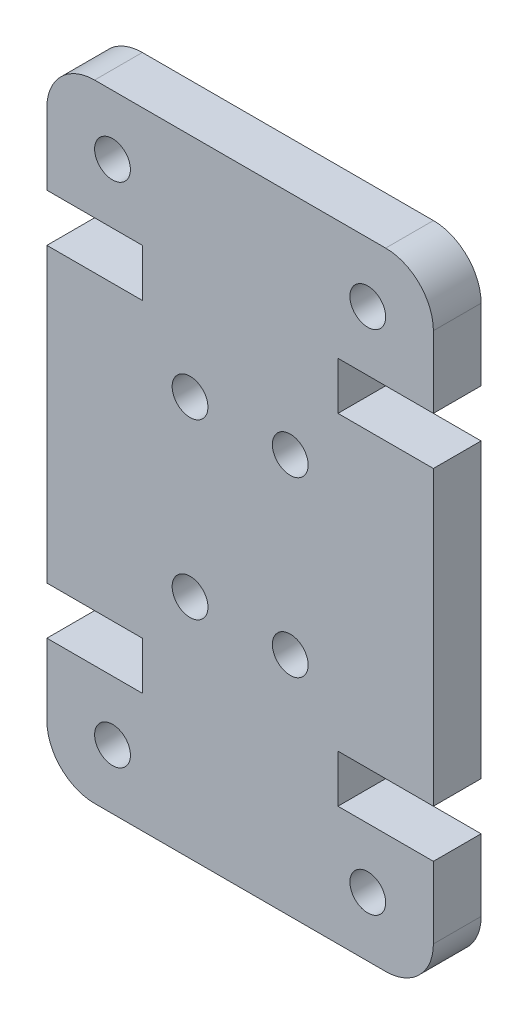
ISO-10303-21;
HEADER;
FILE_DESCRIPTION(('STEP AP214'),'2;1');
FILE_NAME('part.step','',(''),(''),'','','');
FILE_SCHEMA(('AUTOMOTIVE_DESIGN { 1 0 10303 214 1 1 1 1 }'));
ENDSEC;
DATA;
#1=APPLICATION_CONTEXT('core data for automotive mechanical design processes');
#2=APPLICATION_PROTOCOL_DEFINITION('international standard','automotive_design',2000,#1);
#3=PRODUCT_CONTEXT('',#1,'mechanical');
#4=PRODUCT('Part','Part','',(#3));
#5=PRODUCT_RELATED_PRODUCT_CATEGORY('part','',(#4));
#6=PRODUCT_DEFINITION_FORMATION('','',#4);
#7=PRODUCT_DEFINITION_CONTEXT('part definition',#1,'design');
#8=PRODUCT_DEFINITION('design','',#6,#7);
#9=PRODUCT_DEFINITION_SHAPE('','',#8);
#10=(LENGTH_UNIT() NAMED_UNIT(*) SI_UNIT(.MILLI.,.METRE.));
#11=(NAMED_UNIT(*) PLANE_ANGLE_UNIT() SI_UNIT($,.RADIAN.));
#12=(NAMED_UNIT(*) SI_UNIT($,.STERADIAN.) SOLID_ANGLE_UNIT());
#13=UNCERTAINTY_MEASURE_WITH_UNIT(LENGTH_MEASURE(1.E-05),#10,'distance_accuracy_value','');
#14=(GEOMETRIC_REPRESENTATION_CONTEXT(3) GLOBAL_UNCERTAINTY_ASSIGNED_CONTEXT((#13)) GLOBAL_UNIT_ASSIGNED_CONTEXT((#10,
#11,#12)) REPRESENTATION_CONTEXT('',''));
#15=CARTESIAN_POINT('',(0.,0.,0.));
#16=DIRECTION('',(0.,0.,1.));
#17=DIRECTION('',(1.,0.,0.));
#18=AXIS2_PLACEMENT_3D('',#15,#16,#17);
#19=CARTESIAN_POINT('',(14.2,2.,2.));
#20=DIRECTION('',(0.,0.,-1.));
#21=DIRECTION('',(-1.,0.,0.));
#22=AXIS2_PLACEMENT_3D('',#19,#20,#21);
#23=PLANE('',#22);
#24=CARTESIAN_POINT('',(6.00000000000001,9.49999999999963,2.));
#25=DIRECTION('',(0.,0.,1.));
#26=DIRECTION('',(1.,0.,0.));
#27=AXIS2_PLACEMENT_3D('',#24,#25,#26);
#28=CIRCLE('',#27,0.749999999999999);
#29=CARTESIAN_POINT('',(6.75,9.49999999999963,2.));
#30=VERTEX_POINT('',#29);
#31=EDGE_CURVE('E464',#30,#30,#28,.T.);
#32=ORIENTED_EDGE('',*,*,#31,.F.);
#33=EDGE_LOOP('',(#32));
#34=FACE_BOUND('',#33,.T.);
#35=CARTESIAN_POINT('',(10.2,16.7600000000004,2.));
#36=DIRECTION('',(0.,0.,1.));
#37=DIRECTION('',(1.,0.,0.));
#38=AXIS2_PLACEMENT_3D('',#35,#36,#37);
#39=CIRCLE('',#38,0.749999999999999);
#40=CARTESIAN_POINT('',(10.95,16.7600000000004,2.));
#41=VERTEX_POINT('',#40);
#42=EDGE_CURVE('E476',#41,#41,#39,.T.);
#43=ORIENTED_EDGE('',*,*,#42,.F.);
#44=EDGE_LOOP('',(#43));
#45=FACE_BOUND('',#44,.T.);
#46=CARTESIAN_POINT('',(2.75000000000002,23.7599999999998,2.));
#47=DIRECTION('',(0.,0.,1.));
#48=DIRECTION('',(-1.,0.,0.));
#49=AXIS2_PLACEMENT_3D('',#46,#47,#48);
#50=CIRCLE('',#49,0.749999999999999);
#51=CARTESIAN_POINT('',(2.00000000000003,23.7599999999998,2.));
#52=VERTEX_POINT('',#51);
#53=EDGE_CURVE('E488',#52,#52,#50,.T.);
#54=ORIENTED_EDGE('',*,*,#53,.F.);
#55=EDGE_LOOP('',(#54));
#56=FACE_BOUND('',#55,.T.);
#57=CARTESIAN_POINT('',(13.45,2.50000000000017,2.));
#58=DIRECTION('',(0.,0.,1.));
#59=DIRECTION('',(-1.,0.,0.));
#60=AXIS2_PLACEMENT_3D('',#57,#58,#59);
#61=CIRCLE('',#60,0.750000000000004);
#62=CARTESIAN_POINT('',(12.7,2.50000000000017,2.));
#63=VERTEX_POINT('',#62);
#64=EDGE_CURVE('E230',#63,#63,#61,.T.);
#65=ORIENTED_EDGE('',*,*,#64,.F.);
#66=EDGE_LOOP('',(#65));
#67=FACE_BOUND('',#66,.T.);
#68=CARTESIAN_POINT('',(14.2,2.,2.));
#69=DIRECTION('',(0.,0.,1.));
#70=DIRECTION('',(-1.,0.,0.));
#71=AXIS2_PLACEMENT_3D('',#68,#69,#70);
#72=CIRCLE('',#71,2.);
#73=CARTESIAN_POINT('',(14.2,0.,2.));
#74=VERTEX_POINT('',#73);
#75=CARTESIAN_POINT('',(16.2,2.,2.));
#76=VERTEX_POINT('',#75);
#77=EDGE_CURVE('E273',#74,#76,#72,.T.);
#78=ORIENTED_EDGE('',*,*,#77,.T.);
#79=DIRECTION('',(0.,1.,0.));
#80=VECTOR('',#79,1.);
#81=CARTESIAN_POINT('',(16.2,2.,2.));
#82=LINE('',#81,#80);
#83=CARTESIAN_POINT('',(16.2,4.99999999999945,2.));
#84=VERTEX_POINT('',#83);
#85=EDGE_CURVE('E141',#76,#84,#82,.T.);
#86=ORIENTED_EDGE('',*,*,#85,.T.);
#87=DIRECTION('',(-1.,0.,0.));
#88=VECTOR('',#87,1.);
#89=CARTESIAN_POINT('',(12.2,4.99999999999945,2.));
#90=LINE('',#89,#88);
#91=CARTESIAN_POINT('',(12.2,4.99999999999945,2.));
#92=VERTEX_POINT('',#91);
#93=EDGE_CURVE('E336',#84,#92,#90,.T.);
#94=ORIENTED_EDGE('',*,*,#93,.T.);
#95=DIRECTION('',(0.,1.,0.));
#96=VECTOR('',#95,1.);
#97=CARTESIAN_POINT('',(12.2,6.99999999999945,2.));
#98=LINE('',#97,#96);
#99=CARTESIAN_POINT('',(12.2,6.99999999999945,2.));
#100=VERTEX_POINT('',#99);
#101=EDGE_CURVE('E355',#92,#100,#98,.T.);
#102=ORIENTED_EDGE('',*,*,#101,.T.);
#103=DIRECTION('',(1.,0.,0.));
#104=VECTOR('',#103,1.);
#105=CARTESIAN_POINT('',(16.2,6.99999999999945,2.));
#106=LINE('',#105,#104);
#107=CARTESIAN_POINT('',(16.2,6.99999999999945,2.));
#108=VERTEX_POINT('',#107);
#109=EDGE_CURVE('E352',#100,#108,#106,.T.);
#110=ORIENTED_EDGE('',*,*,#109,.T.);
#111=DIRECTION('',(0.,1.,0.));
#112=VECTOR('',#111,1.);
#113=CARTESIAN_POINT('',(16.2,6.99999999999945,2.));
#114=LINE('',#113,#112);
#115=CARTESIAN_POINT('',(16.2,19.2600000000005,2.));
#116=VERTEX_POINT('',#115);
#117=EDGE_CURVE('E354',#108,#116,#114,.T.);
#118=ORIENTED_EDGE('',*,*,#117,.T.);
#119=DIRECTION('',(-1.,0.,0.));
#120=VECTOR('',#119,1.);
#121=CARTESIAN_POINT('',(16.2,19.2600000000005,2.));
#122=LINE('',#121,#120);
#123=CARTESIAN_POINT('',(12.2,19.2600000000005,2.));
#124=VERTEX_POINT('',#123);
#125=EDGE_CURVE('E357',#116,#124,#122,.T.);
#126=ORIENTED_EDGE('',*,*,#125,.T.);
#127=DIRECTION('',(0.,1.,0.));
#128=VECTOR('',#127,1.);
#129=CARTESIAN_POINT('',(12.2,19.2600000000005,2.));
#130=LINE('',#129,#128);
#131=CARTESIAN_POINT('',(12.2,21.2600000000005,2.));
#132=VERTEX_POINT('',#131);
#133=EDGE_CURVE('E363',#124,#132,#130,.T.);
#134=ORIENTED_EDGE('',*,*,#133,.T.);
#135=DIRECTION('',(1.,0.,0.));
#136=VECTOR('',#135,1.);
#137=CARTESIAN_POINT('',(12.2,21.2600000000005,2.));
#138=LINE('',#137,#136);
#139=CARTESIAN_POINT('',(16.2,21.2600000000005,2.));
#140=VERTEX_POINT('',#139);
#141=EDGE_CURVE('E365',#132,#140,#138,.T.);
#142=ORIENTED_EDGE('',*,*,#141,.T.);
#143=DIRECTION('',(0.,1.,0.));
#144=VECTOR('',#143,1.);
#145=CARTESIAN_POINT('',(16.2,24.26,2.));
#146=LINE('',#145,#144);
#147=CARTESIAN_POINT('',(16.2,24.26,2.));
#148=VERTEX_POINT('',#147);
#149=EDGE_CURVE('E367',#140,#148,#146,.T.);
#150=ORIENTED_EDGE('',*,*,#149,.T.);
#151=CARTESIAN_POINT('',(14.2,24.26,2.));
#152=DIRECTION('',(0.,0.,1.));
#153=DIRECTION('',(1.,0.,0.));
#154=AXIS2_PLACEMENT_3D('',#151,#152,#153);
#155=CIRCLE('',#154,2.);
#156=CARTESIAN_POINT('',(14.2,26.26,2.));
#157=VERTEX_POINT('',#156);
#158=EDGE_CURVE('E369',#148,#157,#155,.T.);
#159=ORIENTED_EDGE('',*,*,#158,.T.);
#160=DIRECTION('',(-1.,0.,0.));
#161=VECTOR('',#160,1.);
#162=CARTESIAN_POINT('',(1.99999999999999,26.26,2.));
#163=LINE('',#162,#161);
#164=CARTESIAN_POINT('',(1.99999999999999,26.26,2.));
#165=VERTEX_POINT('',#164);
#166=EDGE_CURVE('E371',#157,#165,#163,.T.);
#167=ORIENTED_EDGE('',*,*,#166,.T.);
#168=CARTESIAN_POINT('',(2.,24.26,2.));
#169=DIRECTION('',(0.,0.,1.));
#170=DIRECTION('',(-1.,0.,0.));
#171=AXIS2_PLACEMENT_3D('',#168,#169,#170);
#172=CIRCLE('',#171,2.);
#173=CARTESIAN_POINT('',(0.,24.26,2.));
#174=VERTEX_POINT('',#173);
#175=EDGE_CURVE('E373',#165,#174,#172,.T.);
#176=ORIENTED_EDGE('',*,*,#175,.T.);
#177=DIRECTION('',(0.,-1.,0.));
#178=VECTOR('',#177,1.);
#179=CARTESIAN_POINT('',(0.,24.26,2.));
#180=LINE('',#179,#178);
#181=CARTESIAN_POINT('',(0.,21.2600000000005,2.));
#182=VERTEX_POINT('',#181);
#183=EDGE_CURVE('E375',#174,#182,#180,.T.);
#184=ORIENTED_EDGE('',*,*,#183,.T.);
#185=DIRECTION('',(1.,0.,0.));
#186=VECTOR('',#185,1.);
#187=CARTESIAN_POINT('',(3.99999999999999,21.2600000000005,2.));
#188=LINE('',#187,#186);
#189=CARTESIAN_POINT('',(3.99999999999999,21.2600000000005,2.));
#190=VERTEX_POINT('',#189);
#191=EDGE_CURVE('E377',#182,#190,#188,.T.);
#192=ORIENTED_EDGE('',*,*,#191,.T.);
#193=DIRECTION('',(0.,-1.,0.));
#194=VECTOR('',#193,1.);
#195=CARTESIAN_POINT('',(4.,19.2600000000005,2.));
#196=LINE('',#195,#194);
#197=CARTESIAN_POINT('',(4.,19.2600000000005,2.));
#198=VERTEX_POINT('',#197);
#199=EDGE_CURVE('E379',#190,#198,#196,.T.);
#200=ORIENTED_EDGE('',*,*,#199,.T.);
#201=DIRECTION('',(-1.,0.,0.));
#202=VECTOR('',#201,1.);
#203=CARTESIAN_POINT('',(0.,19.2600000000005,2.));
#204=LINE('',#203,#202);
#205=CARTESIAN_POINT('',(0.,19.2600000000005,2.));
#206=VERTEX_POINT('',#205);
#207=EDGE_CURVE('E381',#198,#206,#204,.T.);
#208=ORIENTED_EDGE('',*,*,#207,.T.);
#209=DIRECTION('',(0.,-1.,0.));
#210=VECTOR('',#209,1.);
#211=CARTESIAN_POINT('',(0.,6.99999999999945,2.));
#212=LINE('',#211,#210);
#213=CARTESIAN_POINT('',(0.,6.99999999999945,2.));
#214=VERTEX_POINT('',#213);
#215=EDGE_CURVE('E383',#206,#214,#212,.T.);
#216=ORIENTED_EDGE('',*,*,#215,.T.);
#217=DIRECTION('',(1.,0.,0.));
#218=VECTOR('',#217,1.);
#219=CARTESIAN_POINT('',(0.,6.99999999999945,2.));
#220=LINE('',#219,#218);
#221=CARTESIAN_POINT('',(4.,6.99999999999945,2.));
#222=VERTEX_POINT('',#221);
#223=EDGE_CURVE('E385',#214,#222,#220,.T.);
#224=ORIENTED_EDGE('',*,*,#223,.T.);
#225=DIRECTION('',(0.,-1.,0.));
#226=VECTOR('',#225,1.);
#227=CARTESIAN_POINT('',(4.,6.99999999999945,2.));
#228=LINE('',#227,#226);
#229=CARTESIAN_POINT('',(4.,4.99999999999945,2.));
#230=VERTEX_POINT('',#229);
#231=EDGE_CURVE('E387',#222,#230,#228,.T.);
#232=ORIENTED_EDGE('',*,*,#231,.T.);
#233=DIRECTION('',(-1.,0.,0.));
#234=VECTOR('',#233,1.);
#235=CARTESIAN_POINT('',(4.,4.99999999999945,2.));
#236=LINE('',#235,#234);
#237=CARTESIAN_POINT('',(0.,4.99999999999945,2.));
#238=VERTEX_POINT('',#237);
#239=EDGE_CURVE('E208',#230,#238,#236,.T.);
#240=ORIENTED_EDGE('',*,*,#239,.T.);
#241=DIRECTION('',(0.,-1.,0.));
#242=VECTOR('',#241,1.);
#243=CARTESIAN_POINT('',(0.,2.,2.));
#244=LINE('',#243,#242);
#245=CARTESIAN_POINT('',(0.,2.,2.));
#246=VERTEX_POINT('',#245);
#247=EDGE_CURVE('E202',#238,#246,#244,.T.);
#248=ORIENTED_EDGE('',*,*,#247,.T.);
#249=CARTESIAN_POINT('',(2.,2.,2.));
#250=DIRECTION('',(0.,0.,1.));
#251=DIRECTION('',(1.,0.,0.));
#252=AXIS2_PLACEMENT_3D('',#249,#250,#251);
#253=CIRCLE('',#252,2.);
#254=CARTESIAN_POINT('',(2.,0.,2.));
#255=VERTEX_POINT('',#254);
#256=EDGE_CURVE('E206',#246,#255,#253,.T.);
#257=ORIENTED_EDGE('',*,*,#256,.T.);
#258=DIRECTION('',(1.,0.,0.));
#259=VECTOR('',#258,1.);
#260=CARTESIAN_POINT('',(2.,0.,2.));
#261=LINE('',#260,#259);
#262=EDGE_CURVE('E50',#255,#74,#261,.T.);
#263=ORIENTED_EDGE('',*,*,#262,.T.);
#264=EDGE_LOOP('',(#78,#86,#94,#102,#110,#118,#126,#134,#142,#150,#159,#167,#176,#184,#192,#200,
#208,#216,#224,#232,#240,#248,#257,#263));
#265=FACE_BOUND('',#264,.T.);
#266=CARTESIAN_POINT('',(10.2,9.49999999999963,2.));
#267=DIRECTION('',(0.,0.,1.));
#268=DIRECTION('',(-1.,0.,0.));
#269=AXIS2_PLACEMENT_3D('',#266,#267,#268);
#270=CIRCLE('',#269,0.749999999999998);
#271=CARTESIAN_POINT('',(9.45,9.49999999999963,2.));
#272=VERTEX_POINT('',#271);
#273=EDGE_CURVE('E494',#272,#272,#270,.T.);
#274=ORIENTED_EDGE('',*,*,#273,.F.);
#275=EDGE_LOOP('',(#274));
#276=FACE_BOUND('',#275,.T.);
#277=CARTESIAN_POINT('',(6.,16.7600000000004,2.));
#278=DIRECTION('',(0.,0.,1.));
#279=DIRECTION('',(-1.,0.,0.));
#280=AXIS2_PLACEMENT_3D('',#277,#278,#279);
#281=CIRCLE('',#280,0.750000000000001);
#282=CARTESIAN_POINT('',(5.25,16.7600000000004,2.));
#283=VERTEX_POINT('',#282);
#284=EDGE_CURVE('E482',#283,#283,#281,.T.);
#285=ORIENTED_EDGE('',*,*,#284,.F.);
#286=EDGE_LOOP('',(#285));
#287=FACE_BOUND('',#286,.T.);
#288=CARTESIAN_POINT('',(13.45,23.7599999999998,2.));
#289=DIRECTION('',(0.,0.,1.));
#290=DIRECTION('',(1.,0.,0.));
#291=AXIS2_PLACEMENT_3D('',#288,#289,#290);
#292=CIRCLE('',#291,0.750000000000004);
#293=CARTESIAN_POINT('',(14.2,23.7599999999998,2.));
#294=VERTEX_POINT('',#293);
#295=EDGE_CURVE('E470',#294,#294,#292,.T.);
#296=ORIENTED_EDGE('',*,*,#295,.F.);
#297=EDGE_LOOP('',(#296));
#298=FACE_BOUND('',#297,.T.);
#299=CARTESIAN_POINT('',(2.75000000000003,2.50000000000017,2.));
#300=DIRECTION('',(0.,0.,1.));
#301=DIRECTION('',(1.,0.,0.));
#302=AXIS2_PLACEMENT_3D('',#299,#300,#301);
#303=CIRCLE('',#302,0.749999999999999);
#304=CARTESIAN_POINT('',(3.50000000000003,2.50000000000017,2.));
#305=VERTEX_POINT('',#304);
#306=EDGE_CURVE('E455',#305,#305,#303,.T.);
#307=ORIENTED_EDGE('',*,*,#306,.F.);
#308=EDGE_LOOP('',(#307));
#309=FACE_BOUND('',#308,.T.);
#310=ADVANCED_FACE('F33',(#34,#45,#56,#67,#265,#276,#287,#298,#309),#23,.F.);
#311=CARTESIAN_POINT('',(14.2,2.,0.));
#312=DIRECTION('',(0.,0.,-1.));
#313=DIRECTION('',(-1.,0.,0.));
#314=AXIS2_PLACEMENT_3D('',#311,#312,#313);
#315=PLANE('',#314);
#316=CARTESIAN_POINT('',(6.00000000000001,9.49999999999963,0.));
#317=DIRECTION('',(0.,0.,1.));
#318=DIRECTION('',(1.,0.,0.));
#319=AXIS2_PLACEMENT_3D('',#316,#317,#318);
#320=CIRCLE('',#319,0.749999999999999);
#321=CARTESIAN_POINT('',(6.75,9.49999999999963,0.));
#322=VERTEX_POINT('',#321);
#323=EDGE_CURVE('E461',#322,#322,#320,.T.);
#324=ORIENTED_EDGE('',*,*,#323,.T.);
#325=EDGE_LOOP('',(#324));
#326=FACE_BOUND('',#325,.T.);
#327=CARTESIAN_POINT('',(10.2,16.7600000000004,0.));
#328=DIRECTION('',(0.,0.,1.));
#329=DIRECTION('',(1.,0.,0.));
#330=AXIS2_PLACEMENT_3D('',#327,#328,#329);
#331=CIRCLE('',#330,0.749999999999999);
#332=CARTESIAN_POINT('',(10.95,16.7600000000004,0.));
#333=VERTEX_POINT('',#332);
#334=EDGE_CURVE('E473',#333,#333,#331,.T.);
#335=ORIENTED_EDGE('',*,*,#334,.T.);
#336=EDGE_LOOP('',(#335));
#337=FACE_BOUND('',#336,.T.);
#338=CARTESIAN_POINT('',(2.75000000000002,23.7599999999998,0.));
#339=DIRECTION('',(0.,0.,1.));
#340=DIRECTION('',(-1.,0.,0.));
#341=AXIS2_PLACEMENT_3D('',#338,#339,#340);
#342=CIRCLE('',#341,0.749999999999999);
#343=CARTESIAN_POINT('',(2.00000000000003,23.7599999999998,0.));
#344=VERTEX_POINT('',#343);
#345=EDGE_CURVE('E485',#344,#344,#342,.T.);
#346=ORIENTED_EDGE('',*,*,#345,.T.);
#347=EDGE_LOOP('',(#346));
#348=FACE_BOUND('',#347,.T.);
#349=CARTESIAN_POINT('',(13.45,2.50000000000017,0.));
#350=DIRECTION('',(0.,0.,1.));
#351=DIRECTION('',(-1.,0.,0.));
#352=AXIS2_PLACEMENT_3D('',#349,#350,#351);
#353=CIRCLE('',#352,0.750000000000004);
#354=CARTESIAN_POINT('',(12.7,2.50000000000017,0.));
#355=VERTEX_POINT('',#354);
#356=EDGE_CURVE('E497',#355,#355,#353,.T.);
#357=ORIENTED_EDGE('',*,*,#356,.T.);
#358=EDGE_LOOP('',(#357));
#359=FACE_BOUND('',#358,.T.);
#360=CARTESIAN_POINT('',(14.2,2.,0.));
#361=DIRECTION('',(0.,0.,1.));
#362=DIRECTION('',(-1.,0.,0.));
#363=AXIS2_PLACEMENT_3D('',#360,#361,#362);
#364=CIRCLE('',#363,2.);
#365=CARTESIAN_POINT('',(14.2,0.,0.));
#366=VERTEX_POINT('',#365);
#367=CARTESIAN_POINT('',(16.2,2.,0.));
#368=VERTEX_POINT('',#367);
#369=EDGE_CURVE('E226',#366,#368,#364,.T.);
#370=ORIENTED_EDGE('',*,*,#369,.F.);
#371=DIRECTION('',(1.,0.,0.));
#372=VECTOR('',#371,1.);
#373=CARTESIAN_POINT('',(2.,0.,0.));
#374=LINE('',#373,#372);
#375=CARTESIAN_POINT('',(2.,0.,0.));
#376=VERTEX_POINT('',#375);
#377=EDGE_CURVE('E133',#376,#366,#374,.T.);
#378=ORIENTED_EDGE('',*,*,#377,.F.);
#379=CARTESIAN_POINT('',(2.,2.,0.));
#380=DIRECTION('',(0.,0.,1.));
#381=DIRECTION('',(1.,0.,0.));
#382=AXIS2_PLACEMENT_3D('',#379,#380,#381);
#383=CIRCLE('',#382,2.);
#384=CARTESIAN_POINT('',(0.,2.,0.));
#385=VERTEX_POINT('',#384);
#386=EDGE_CURVE('E127',#385,#376,#383,.T.);
#387=ORIENTED_EDGE('',*,*,#386,.F.);
#388=DIRECTION('',(0.,-1.,0.));
#389=VECTOR('',#388,1.);
#390=CARTESIAN_POINT('',(0.,2.,0.));
#391=LINE('',#390,#389);
#392=CARTESIAN_POINT('',(0.,4.99999999999945,0.));
#393=VERTEX_POINT('',#392);
#394=EDGE_CURVE('E216',#393,#385,#391,.T.);
#395=ORIENTED_EDGE('',*,*,#394,.F.);
#396=DIRECTION('',(-1.,0.,0.));
#397=VECTOR('',#396,1.);
#398=CARTESIAN_POINT('',(4.,4.99999999999945,0.));
#399=LINE('',#398,#397);
#400=CARTESIAN_POINT('',(4.,4.99999999999945,0.));
#401=VERTEX_POINT('',#400);
#402=EDGE_CURVE('E268',#401,#393,#399,.T.);
#403=ORIENTED_EDGE('',*,*,#402,.F.);
#404=DIRECTION('',(0.,-1.,0.));
#405=VECTOR('',#404,1.);
#406=CARTESIAN_POINT('',(4.,6.99999999999945,0.));
#407=LINE('',#406,#405);
#408=CARTESIAN_POINT('',(4.,6.99999999999945,0.));
#409=VERTEX_POINT('',#408);
#410=EDGE_CURVE('E266',#409,#401,#407,.T.);
#411=ORIENTED_EDGE('',*,*,#410,.F.);
#412=DIRECTION('',(1.,0.,0.));
#413=VECTOR('',#412,1.);
#414=CARTESIAN_POINT('',(0.,6.99999999999945,0.));
#415=LINE('',#414,#413);
#416=CARTESIAN_POINT('',(0.,6.99999999999945,0.));
#417=VERTEX_POINT('',#416);
#418=EDGE_CURVE('E264',#417,#409,#415,.T.);
#419=ORIENTED_EDGE('',*,*,#418,.F.);
#420=DIRECTION('',(0.,-1.,0.));
#421=VECTOR('',#420,1.);
#422=CARTESIAN_POINT('',(0.,6.99999999999945,0.));
#423=LINE('',#422,#421);
#424=CARTESIAN_POINT('',(0.,19.2600000000005,0.));
#425=VERTEX_POINT('',#424);
#426=EDGE_CURVE('E262',#425,#417,#423,.T.);
#427=ORIENTED_EDGE('',*,*,#426,.F.);
#428=DIRECTION('',(-1.,0.,0.));
#429=VECTOR('',#428,1.);
#430=CARTESIAN_POINT('',(0.,19.2600000000005,0.));
#431=LINE('',#430,#429);
#432=CARTESIAN_POINT('',(4.,19.2600000000005,0.));
#433=VERTEX_POINT('',#432);
#434=EDGE_CURVE('E260',#433,#425,#431,.T.);
#435=ORIENTED_EDGE('',*,*,#434,.F.);
#436=DIRECTION('',(0.,-1.,0.));
#437=VECTOR('',#436,1.);
#438=CARTESIAN_POINT('',(4.,19.2600000000005,0.));
#439=LINE('',#438,#437);
#440=CARTESIAN_POINT('',(3.99999999999999,21.2600000000005,0.));
#441=VERTEX_POINT('',#440);
#442=EDGE_CURVE('E258',#441,#433,#439,.T.);
#443=ORIENTED_EDGE('',*,*,#442,.F.);
#444=DIRECTION('',(1.,0.,0.));
#445=VECTOR('',#444,1.);
#446=CARTESIAN_POINT('',(3.99999999999999,21.2600000000005,0.));
#447=LINE('',#446,#445);
#448=CARTESIAN_POINT('',(0.,21.2600000000005,0.));
#449=VERTEX_POINT('',#448);
#450=EDGE_CURVE('E256',#449,#441,#447,.T.);
#451=ORIENTED_EDGE('',*,*,#450,.F.);
#452=DIRECTION('',(0.,-1.,0.));
#453=VECTOR('',#452,1.);
#454=CARTESIAN_POINT('',(0.,24.26,0.));
#455=LINE('',#454,#453);
#456=CARTESIAN_POINT('',(0.,24.26,0.));
#457=VERTEX_POINT('',#456);
#458=EDGE_CURVE('E254',#457,#449,#455,.T.);
#459=ORIENTED_EDGE('',*,*,#458,.F.);
#460=CARTESIAN_POINT('',(2.,24.26,0.));
#461=DIRECTION('',(0.,0.,1.));
#462=DIRECTION('',(-1.,0.,0.));
#463=AXIS2_PLACEMENT_3D('',#460,#461,#462);
#464=CIRCLE('',#463,2.);
#465=CARTESIAN_POINT('',(1.99999999999999,26.26,0.));
#466=VERTEX_POINT('',#465);
#467=EDGE_CURVE('E252',#466,#457,#464,.T.);
#468=ORIENTED_EDGE('',*,*,#467,.F.);
#469=DIRECTION('',(-1.,0.,0.));
#470=VECTOR('',#469,1.);
#471=CARTESIAN_POINT('',(1.99999999999999,26.26,0.));
#472=LINE('',#471,#470);
#473=CARTESIAN_POINT('',(14.2,26.26,0.));
#474=VERTEX_POINT('',#473);
#475=EDGE_CURVE('E250',#474,#466,#472,.T.);
#476=ORIENTED_EDGE('',*,*,#475,.F.);
#477=CARTESIAN_POINT('',(14.2,24.26,0.));
#478=DIRECTION('',(0.,0.,1.));
#479=DIRECTION('',(1.,0.,0.));
#480=AXIS2_PLACEMENT_3D('',#477,#478,#479);
#481=CIRCLE('',#480,2.);
#482=CARTESIAN_POINT('',(16.2,24.26,0.));
#483=VERTEX_POINT('',#482);
#484=EDGE_CURVE('E248',#483,#474,#481,.T.);
#485=ORIENTED_EDGE('',*,*,#484,.F.);
#486=DIRECTION('',(0.,1.,0.));
#487=VECTOR('',#486,1.);
#488=CARTESIAN_POINT('',(16.2,24.26,0.));
#489=LINE('',#488,#487);
#490=CARTESIAN_POINT('',(16.2,21.2600000000005,0.));
#491=VERTEX_POINT('',#490);
#492=EDGE_CURVE('E246',#491,#483,#489,.T.);
#493=ORIENTED_EDGE('',*,*,#492,.F.);
#494=DIRECTION('',(1.,0.,0.));
#495=VECTOR('',#494,1.);
#496=CARTESIAN_POINT('',(12.2,21.2600000000005,0.));
#497=LINE('',#496,#495);
#498=CARTESIAN_POINT('',(12.2,21.2600000000005,0.));
#499=VERTEX_POINT('',#498);
#500=EDGE_CURVE('E244',#499,#491,#497,.T.);
#501=ORIENTED_EDGE('',*,*,#500,.F.);
#502=DIRECTION('',(0.,1.,0.));
#503=VECTOR('',#502,1.);
#504=CARTESIAN_POINT('',(12.2,19.2600000000005,0.));
#505=LINE('',#504,#503);
#506=CARTESIAN_POINT('',(12.2,19.2600000000005,0.));
#507=VERTEX_POINT('',#506);
#508=EDGE_CURVE('E242',#507,#499,#505,.T.);
#509=ORIENTED_EDGE('',*,*,#508,.F.);
#510=DIRECTION('',(-1.,0.,0.));
#511=VECTOR('',#510,1.);
#512=CARTESIAN_POINT('',(16.2,19.2600000000005,0.));
#513=LINE('',#512,#511);
#514=CARTESIAN_POINT('',(16.2,19.2600000000005,0.));
#515=VERTEX_POINT('',#514);
#516=EDGE_CURVE('E240',#515,#507,#513,.T.);
#517=ORIENTED_EDGE('',*,*,#516,.F.);
#518=DIRECTION('',(0.,1.,0.));
#519=VECTOR('',#518,1.);
#520=CARTESIAN_POINT('',(16.2,6.99999999999945,0.));
#521=LINE('',#520,#519);
#522=CARTESIAN_POINT('',(16.2,6.99999999999945,0.));
#523=VERTEX_POINT('',#522);
#524=EDGE_CURVE('E238',#523,#515,#521,.T.);
#525=ORIENTED_EDGE('',*,*,#524,.F.);
#526=DIRECTION('',(1.,0.,0.));
#527=VECTOR('',#526,1.);
#528=CARTESIAN_POINT('',(16.2,6.99999999999945,0.));
#529=LINE('',#528,#527);
#530=CARTESIAN_POINT('',(12.2,6.99999999999945,0.));
#531=VERTEX_POINT('',#530);
#532=EDGE_CURVE('E236',#531,#523,#529,.T.);
#533=ORIENTED_EDGE('',*,*,#532,.F.);
#534=DIRECTION('',(0.,1.,0.));
#535=VECTOR('',#534,1.);
#536=CARTESIAN_POINT('',(12.2,6.99999999999945,0.));
#537=LINE('',#536,#535);
#538=CARTESIAN_POINT('',(12.2,4.99999999999945,0.));
#539=VERTEX_POINT('',#538);
#540=EDGE_CURVE('E234',#539,#531,#537,.T.);
#541=ORIENTED_EDGE('',*,*,#540,.F.);
#542=DIRECTION('',(-1.,0.,0.));
#543=VECTOR('',#542,1.);
#544=CARTESIAN_POINT('',(12.2,4.99999999999945,0.));
#545=LINE('',#544,#543);
#546=CARTESIAN_POINT('',(16.2,4.99999999999945,0.));
#547=VERTEX_POINT('',#546);
#548=EDGE_CURVE('E232',#547,#539,#545,.T.);
#549=ORIENTED_EDGE('',*,*,#548,.F.);
#550=DIRECTION('',(0.,1.,0.));
#551=VECTOR('',#550,1.);
#552=CARTESIAN_POINT('',(16.2,2.,0.));
#553=LINE('',#552,#551);
#554=EDGE_CURVE('E229',#368,#547,#553,.T.);
#555=ORIENTED_EDGE('',*,*,#554,.F.);
#556=EDGE_LOOP('',(#370,#378,#387,#395,#403,#411,#419,#427,#435,#443,#451,#459,#468,#476,#485,
#493,#501,#509,#517,#525,#533,#541,#549,#555));
#557=FACE_BOUND('',#556,.T.);
#558=CARTESIAN_POINT('',(10.2,9.49999999999963,0.));
#559=DIRECTION('',(0.,0.,1.));
#560=DIRECTION('',(-1.,0.,0.));
#561=AXIS2_PLACEMENT_3D('',#558,#559,#560);
#562=CIRCLE('',#561,0.749999999999998);
#563=CARTESIAN_POINT('',(9.45,9.49999999999963,0.));
#564=VERTEX_POINT('',#563);
#565=EDGE_CURVE('E491',#564,#564,#562,.T.);
#566=ORIENTED_EDGE('',*,*,#565,.T.);
#567=EDGE_LOOP('',(#566));
#568=FACE_BOUND('',#567,.T.);
#569=CARTESIAN_POINT('',(6.,16.7600000000004,0.));
#570=DIRECTION('',(0.,0.,1.));
#571=DIRECTION('',(-1.,0.,0.));
#572=AXIS2_PLACEMENT_3D('',#569,#570,#571);
#573=CIRCLE('',#572,0.750000000000001);
#574=CARTESIAN_POINT('',(5.25,16.7600000000004,0.));
#575=VERTEX_POINT('',#574);
#576=EDGE_CURVE('E479',#575,#575,#573,.T.);
#577=ORIENTED_EDGE('',*,*,#576,.T.);
#578=EDGE_LOOP('',(#577));
#579=FACE_BOUND('',#578,.T.);
#580=CARTESIAN_POINT('',(13.45,23.7599999999998,0.));
#581=DIRECTION('',(0.,0.,1.));
#582=DIRECTION('',(1.,0.,0.));
#583=AXIS2_PLACEMENT_3D('',#580,#581,#582);
#584=CIRCLE('',#583,0.750000000000004);
#585=CARTESIAN_POINT('',(14.2,23.7599999999998,0.));
#586=VERTEX_POINT('',#585);
#587=EDGE_CURVE('E467',#586,#586,#584,.T.);
#588=ORIENTED_EDGE('',*,*,#587,.T.);
#589=EDGE_LOOP('',(#588));
#590=FACE_BOUND('',#589,.T.);
#591=CARTESIAN_POINT('',(2.75000000000003,2.50000000000017,0.));
#592=DIRECTION('',(0.,0.,1.));
#593=DIRECTION('',(1.,0.,0.));
#594=AXIS2_PLACEMENT_3D('',#591,#592,#593);
#595=CIRCLE('',#594,0.749999999999999);
#596=CARTESIAN_POINT('',(3.50000000000003,2.50000000000017,0.));
#597=VERTEX_POINT('',#596);
#598=EDGE_CURVE('E458',#597,#597,#595,.T.);
#599=ORIENTED_EDGE('',*,*,#598,.T.);
#600=EDGE_LOOP('',(#599));
#601=FACE_BOUND('',#600,.T.);
#602=ADVANCED_FACE('F340',(#326,#337,#348,#359,#557,#568,#579,#590,#601),#315,.T.);
#603=CARTESIAN_POINT('',(14.2,2.,2.));
#604=DIRECTION('',(0.,0.,-1.));
#605=DIRECTION('',(-1.,0.,0.));
#606=AXIS2_PLACEMENT_3D('',#603,#604,#605);
#607=CYLINDRICAL_SURFACE('',#606,2.);
#608=ORIENTED_EDGE('',*,*,#369,.T.);
#609=DIRECTION('',(0.,0.,-1.));
#610=VECTOR('',#609,1.);
#611=CARTESIAN_POINT('',(16.2,2.,2.));
#612=LINE('',#611,#610);
#613=EDGE_CURVE('E11',#76,#368,#612,.T.);
#614=ORIENTED_EDGE('',*,*,#613,.F.);
#615=ORIENTED_EDGE('',*,*,#77,.F.);
#616=DIRECTION('',(0.,0.,-1.));
#617=VECTOR('',#616,1.);
#618=CARTESIAN_POINT('',(14.2,0.,2.));
#619=LINE('',#618,#617);
#620=EDGE_CURVE('E222',#74,#366,#619,.T.);
#621=ORIENTED_EDGE('',*,*,#620,.T.);
#622=EDGE_LOOP('',(#608,#614,#615,#621));
#623=FACE_BOUND('',#622,.T.);
#624=ADVANCED_FACE('F35',(#623),#607,.T.);
#625=CARTESIAN_POINT('',(16.2,2.,2.));
#626=DIRECTION('',(-1.,0.,0.));
#627=DIRECTION('',(0.,0.,1.));
#628=AXIS2_PLACEMENT_3D('',#625,#626,#627);
#629=PLANE('',#628);
#630=ORIENTED_EDGE('',*,*,#554,.T.);
#631=DIRECTION('',(0.,0.,-1.));
#632=VECTOR('',#631,1.);
#633=CARTESIAN_POINT('',(16.2,4.99999999999945,2.));
#634=LINE('',#633,#632);
#635=EDGE_CURVE('E42',#84,#547,#634,.T.);
#636=ORIENTED_EDGE('',*,*,#635,.F.);
#637=ORIENTED_EDGE('',*,*,#85,.F.);
#638=ORIENTED_EDGE('',*,*,#613,.T.);
#639=EDGE_LOOP('',(#630,#636,#637,#638));
#640=FACE_BOUND('',#639,.T.);
#641=ADVANCED_FACE('F762',(#640),#629,.F.);
#642=CARTESIAN_POINT('',(12.2,4.99999999999945,2.));
#643=DIRECTION('',(0.,-1.,0.));
#644=DIRECTION('',(0.,0.,-1.));
#645=AXIS2_PLACEMENT_3D('',#642,#643,#644);
#646=PLANE('',#645);
#647=ORIENTED_EDGE('',*,*,#548,.T.);
#648=DIRECTION('',(0.,0.,-1.));
#649=VECTOR('',#648,1.);
#650=CARTESIAN_POINT('',(12.2,4.99999999999945,2.));
#651=LINE('',#650,#649);
#652=EDGE_CURVE('E328',#92,#539,#651,.T.);
#653=ORIENTED_EDGE('',*,*,#652,.F.);
#654=ORIENTED_EDGE('',*,*,#93,.F.);
#655=ORIENTED_EDGE('',*,*,#635,.T.);
#656=EDGE_LOOP('',(#647,#653,#654,#655));
#657=FACE_BOUND('',#656,.T.);
#658=ADVANCED_FACE('F334',(#657),#646,.F.);
#659=CARTESIAN_POINT('',(12.2,6.99999999999945,2.));
#660=DIRECTION('',(-1.,0.,0.));
#661=DIRECTION('',(0.,-1.,0.));
#662=AXIS2_PLACEMENT_3D('',#659,#660,#661);
#663=PLANE('',#662);
#664=ORIENTED_EDGE('',*,*,#540,.T.);
#665=DIRECTION('',(0.,0.,-1.));
#666=VECTOR('',#665,1.);
#667=CARTESIAN_POINT('',(12.2,6.99999999999945,2.));
#668=LINE('',#667,#666);
#669=EDGE_CURVE('E325',#100,#531,#668,.T.);
#670=ORIENTED_EDGE('',*,*,#669,.F.);
#671=ORIENTED_EDGE('',*,*,#101,.F.);
#672=ORIENTED_EDGE('',*,*,#652,.T.);
#673=EDGE_LOOP('',(#664,#670,#671,#672));
#674=FACE_BOUND('',#673,.T.);
#675=ADVANCED_FACE('F346',(#674),#663,.F.);
#676=CARTESIAN_POINT('',(16.2,6.99999999999945,2.));
#677=DIRECTION('',(0.,1.,0.));
#678=DIRECTION('',(-1.,0.,0.));
#679=AXIS2_PLACEMENT_3D('',#676,#677,#678);
#680=PLANE('',#679);
#681=ORIENTED_EDGE('',*,*,#532,.T.);
#682=DIRECTION('',(0.,0.,-1.));
#683=VECTOR('',#682,1.);
#684=CARTESIAN_POINT('',(16.2,6.99999999999945,2.));
#685=LINE('',#684,#683);
#686=EDGE_CURVE('E322',#108,#523,#685,.T.);
#687=ORIENTED_EDGE('',*,*,#686,.F.);
#688=ORIENTED_EDGE('',*,*,#109,.F.);
#689=ORIENTED_EDGE('',*,*,#669,.T.);
#690=EDGE_LOOP('',(#681,#687,#688,#689));
#691=FACE_BOUND('',#690,.T.);
#692=ADVANCED_FACE('F350',(#691),#680,.F.);
#693=CARTESIAN_POINT('',(16.2,6.99999999999945,2.));
#694=DIRECTION('',(-1.,0.,0.));
#695=DIRECTION('',(0.,0.,1.));
#696=AXIS2_PLACEMENT_3D('',#693,#694,#695);
#697=PLANE('',#696);
#698=ORIENTED_EDGE('',*,*,#524,.T.);
#699=DIRECTION('',(0.,0.,-1.));
#700=VECTOR('',#699,1.);
#701=CARTESIAN_POINT('',(16.2,19.2600000000005,2.));
#702=LINE('',#701,#700);
#703=EDGE_CURVE('E319',#116,#515,#702,.T.);
#704=ORIENTED_EDGE('',*,*,#703,.F.);
#705=ORIENTED_EDGE('',*,*,#117,.F.);
#706=ORIENTED_EDGE('',*,*,#686,.T.);
#707=EDGE_LOOP('',(#698,#704,#705,#706));
#708=FACE_BOUND('',#707,.T.);
#709=ADVANCED_FACE('F727',(#708),#697,.F.);
#710=CARTESIAN_POINT('',(16.2,19.2600000000005,2.));
#711=DIRECTION('',(0.,-1.,0.));
#712=DIRECTION('',(0.,0.,-1.));
#713=AXIS2_PLACEMENT_3D('',#710,#711,#712);
#714=PLANE('',#713);
#715=ORIENTED_EDGE('',*,*,#516,.T.);
#716=DIRECTION('',(0.,0.,-1.));
#717=VECTOR('',#716,1.);
#718=CARTESIAN_POINT('',(12.2,19.2600000000005,2.));
#719=LINE('',#718,#717);
#720=EDGE_CURVE('E316',#124,#507,#719,.T.);
#721=ORIENTED_EDGE('',*,*,#720,.F.);
#722=ORIENTED_EDGE('',*,*,#125,.F.);
#723=ORIENTED_EDGE('',*,*,#703,.T.);
#724=EDGE_LOOP('',(#715,#721,#722,#723));
#725=FACE_BOUND('',#724,.T.);
#726=ADVANCED_FACE('F717',(#725),#714,.F.);
#727=CARTESIAN_POINT('',(12.2,19.2600000000005,2.));
#728=DIRECTION('',(-1.,0.,0.));
#729=DIRECTION('',(0.,-1.,0.));
#730=AXIS2_PLACEMENT_3D('',#727,#728,#729);
#731=PLANE('',#730);
#732=ORIENTED_EDGE('',*,*,#508,.T.);
#733=DIRECTION('',(0.,0.,-1.));
#734=VECTOR('',#733,1.);
#735=CARTESIAN_POINT('',(12.2,21.2600000000005,2.));
#736=LINE('',#735,#734);
#737=EDGE_CURVE('E313',#132,#499,#736,.T.);
#738=ORIENTED_EDGE('',*,*,#737,.F.);
#739=ORIENTED_EDGE('',*,*,#133,.F.);
#740=ORIENTED_EDGE('',*,*,#720,.T.);
#741=EDGE_LOOP('',(#732,#738,#739,#740));
#742=FACE_BOUND('',#741,.T.);
#743=ADVANCED_FACE('F707',(#742),#731,.F.);
#744=CARTESIAN_POINT('',(12.2,21.2600000000005,2.));
#745=DIRECTION('',(0.,1.,0.));
#746=DIRECTION('',(0.,0.,1.));
#747=AXIS2_PLACEMENT_3D('',#744,#745,#746);
#748=PLANE('',#747);
#749=ORIENTED_EDGE('',*,*,#500,.T.);
#750=DIRECTION('',(0.,0.,-1.));
#751=VECTOR('',#750,1.);
#752=CARTESIAN_POINT('',(16.2,21.2600000000005,2.));
#753=LINE('',#752,#751);
#754=EDGE_CURVE('E310',#140,#491,#753,.T.);
#755=ORIENTED_EDGE('',*,*,#754,.F.);
#756=ORIENTED_EDGE('',*,*,#141,.F.);
#757=ORIENTED_EDGE('',*,*,#737,.T.);
#758=EDGE_LOOP('',(#749,#755,#756,#757));
#759=FACE_BOUND('',#758,.T.);
#760=ADVANCED_FACE('F697',(#759),#748,.F.);
#761=CARTESIAN_POINT('',(16.2,24.26,2.));
#762=DIRECTION('',(-1.,0.,0.));
#763=DIRECTION('',(0.,0.,1.));
#764=AXIS2_PLACEMENT_3D('',#761,#762,#763);
#765=PLANE('',#764);
#766=ORIENTED_EDGE('',*,*,#492,.T.);
#767=DIRECTION('',(0.,0.,-1.));
#768=VECTOR('',#767,1.);
#769=CARTESIAN_POINT('',(16.2,24.26,2.));
#770=LINE('',#769,#768);
#771=EDGE_CURVE('E307',#148,#483,#770,.T.);
#772=ORIENTED_EDGE('',*,*,#771,.F.);
#773=ORIENTED_EDGE('',*,*,#149,.F.);
#774=ORIENTED_EDGE('',*,*,#754,.T.);
#775=EDGE_LOOP('',(#766,#772,#773,#774));
#776=FACE_BOUND('',#775,.T.);
#777=ADVANCED_FACE('F687',(#776),#765,.F.);
#778=CARTESIAN_POINT('',(14.2,24.26,2.));
#779=DIRECTION('',(0.,0.,-1.));
#780=DIRECTION('',(-1.,0.,0.));
#781=AXIS2_PLACEMENT_3D('',#778,#779,#780);
#782=CYLINDRICAL_SURFACE('',#781,2.);
#783=ORIENTED_EDGE('',*,*,#484,.T.);
#784=DIRECTION('',(0.,0.,-1.));
#785=VECTOR('',#784,1.);
#786=CARTESIAN_POINT('',(14.2,26.26,2.));
#787=LINE('',#786,#785);
#788=EDGE_CURVE('E304',#157,#474,#787,.T.);
#789=ORIENTED_EDGE('',*,*,#788,.F.);
#790=ORIENTED_EDGE('',*,*,#158,.F.);
#791=ORIENTED_EDGE('',*,*,#771,.T.);
#792=EDGE_LOOP('',(#783,#789,#790,#791));
#793=FACE_BOUND('',#792,.T.);
#794=ADVANCED_FACE('F677',(#793),#782,.T.);
#795=CARTESIAN_POINT('',(1.99999999999999,26.26,2.));
#796=DIRECTION('',(0.,-1.,0.));
#797=DIRECTION('',(0.,0.,-1.));
#798=AXIS2_PLACEMENT_3D('',#795,#796,#797);
#799=PLANE('',#798);
#800=ORIENTED_EDGE('',*,*,#475,.T.);
#801=DIRECTION('',(0.,0.,-1.));
#802=VECTOR('',#801,1.);
#803=CARTESIAN_POINT('',(1.99999999999999,26.26,2.));
#804=LINE('',#803,#802);
#805=EDGE_CURVE('E301',#165,#466,#804,.T.);
#806=ORIENTED_EDGE('',*,*,#805,.F.);
#807=ORIENTED_EDGE('',*,*,#166,.F.);
#808=ORIENTED_EDGE('',*,*,#788,.T.);
#809=EDGE_LOOP('',(#800,#806,#807,#808));
#810=FACE_BOUND('',#809,.T.);
#811=ADVANCED_FACE('F667',(#810),#799,.F.);
#812=CARTESIAN_POINT('',(2.,24.26,2.));
#813=DIRECTION('',(0.,0.,-1.));
#814=DIRECTION('',(-1.,0.,0.));
#815=AXIS2_PLACEMENT_3D('',#812,#813,#814);
#816=CYLINDRICAL_SURFACE('',#815,2.);
#817=ORIENTED_EDGE('',*,*,#467,.T.);
#818=DIRECTION('',(0.,0.,-1.));
#819=VECTOR('',#818,1.);
#820=CARTESIAN_POINT('',(0.,24.26,2.));
#821=LINE('',#820,#819);
#822=EDGE_CURVE('E298',#174,#457,#821,.T.);
#823=ORIENTED_EDGE('',*,*,#822,.F.);
#824=ORIENTED_EDGE('',*,*,#175,.F.);
#825=ORIENTED_EDGE('',*,*,#805,.T.);
#826=EDGE_LOOP('',(#817,#823,#824,#825));
#827=FACE_BOUND('',#826,.T.);
#828=ADVANCED_FACE('F657',(#827),#816,.T.);
#829=CARTESIAN_POINT('',(0.,24.26,2.));
#830=DIRECTION('',(1.,0.,0.));
#831=DIRECTION('',(0.,1.,0.));
#832=AXIS2_PLACEMENT_3D('',#829,#830,#831);
#833=PLANE('',#832);
#834=ORIENTED_EDGE('',*,*,#458,.T.);
#835=DIRECTION('',(0.,0.,-1.));
#836=VECTOR('',#835,1.);
#837=CARTESIAN_POINT('',(0.,21.2600000000005,2.));
#838=LINE('',#837,#836);
#839=EDGE_CURVE('E295',#182,#449,#838,.T.);
#840=ORIENTED_EDGE('',*,*,#839,.F.);
#841=ORIENTED_EDGE('',*,*,#183,.F.);
#842=ORIENTED_EDGE('',*,*,#822,.T.);
#843=EDGE_LOOP('',(#834,#840,#841,#842));
#844=FACE_BOUND('',#843,.T.);
#845=ADVANCED_FACE('F647',(#844),#833,.F.);
#846=CARTESIAN_POINT('',(3.99999999999999,21.2600000000005,2.));
#847=DIRECTION('',(0.,1.,0.));
#848=DIRECTION('',(-1.,0.,0.));
#849=AXIS2_PLACEMENT_3D('',#846,#847,#848);
#850=PLANE('',#849);
#851=ORIENTED_EDGE('',*,*,#450,.T.);
#852=DIRECTION('',(0.,0.,-1.));
#853=VECTOR('',#852,1.);
#854=CARTESIAN_POINT('',(3.99999999999999,21.2600000000005,2.));
#855=LINE('',#854,#853);
#856=EDGE_CURVE('E292',#190,#441,#855,.T.);
#857=ORIENTED_EDGE('',*,*,#856,.F.);
#858=ORIENTED_EDGE('',*,*,#191,.F.);
#859=ORIENTED_EDGE('',*,*,#839,.T.);
#860=EDGE_LOOP('',(#851,#857,#858,#859));
#861=FACE_BOUND('',#860,.T.);
#862=ADVANCED_FACE('F637',(#861),#850,.F.);
#863=CARTESIAN_POINT('',(4.,19.2600000000005,2.));
#864=DIRECTION('',(1.,0.,0.));
#865=DIRECTION('',(0.,1.,0.));
#866=AXIS2_PLACEMENT_3D('',#863,#864,#865);
#867=PLANE('',#866);
#868=ORIENTED_EDGE('',*,*,#442,.T.);
#869=DIRECTION('',(0.,0.,-1.));
#870=VECTOR('',#869,1.);
#871=CARTESIAN_POINT('',(4.,19.2600000000005,2.));
#872=LINE('',#871,#870);
#873=EDGE_CURVE('E289',#198,#433,#872,.T.);
#874=ORIENTED_EDGE('',*,*,#873,.F.);
#875=ORIENTED_EDGE('',*,*,#199,.F.);
#876=ORIENTED_EDGE('',*,*,#856,.T.);
#877=EDGE_LOOP('',(#868,#874,#875,#876));
#878=FACE_BOUND('',#877,.T.);
#879=ADVANCED_FACE('F627',(#878),#867,.F.);
#880=CARTESIAN_POINT('',(0.,19.2600000000005,2.));
#881=DIRECTION('',(0.,-1.,0.));
#882=DIRECTION('',(1.,0.,0.));
#883=AXIS2_PLACEMENT_3D('',#880,#881,#882);
#884=PLANE('',#883);
#885=ORIENTED_EDGE('',*,*,#434,.T.);
#886=DIRECTION('',(0.,0.,-1.));
#887=VECTOR('',#886,1.);
#888=CARTESIAN_POINT('',(0.,19.2600000000005,2.));
#889=LINE('',#888,#887);
#890=EDGE_CURVE('E286',#206,#425,#889,.T.);
#891=ORIENTED_EDGE('',*,*,#890,.F.);
#892=ORIENTED_EDGE('',*,*,#207,.F.);
#893=ORIENTED_EDGE('',*,*,#873,.T.);
#894=EDGE_LOOP('',(#885,#891,#892,#893));
#895=FACE_BOUND('',#894,.T.);
#896=ADVANCED_FACE('F617',(#895),#884,.F.);
#897=CARTESIAN_POINT('',(0.,6.99999999999945,2.));
#898=DIRECTION('',(1.,0.,0.));
#899=DIRECTION('',(0.,1.,0.));
#900=AXIS2_PLACEMENT_3D('',#897,#898,#899);
#901=PLANE('',#900);
#902=ORIENTED_EDGE('',*,*,#426,.T.);
#903=DIRECTION('',(0.,0.,-1.));
#904=VECTOR('',#903,1.);
#905=CARTESIAN_POINT('',(0.,6.99999999999945,2.));
#906=LINE('',#905,#904);
#907=EDGE_CURVE('E283',#214,#417,#906,.T.);
#908=ORIENTED_EDGE('',*,*,#907,.F.);
#909=ORIENTED_EDGE('',*,*,#215,.F.);
#910=ORIENTED_EDGE('',*,*,#890,.T.);
#911=EDGE_LOOP('',(#902,#908,#909,#910));
#912=FACE_BOUND('',#911,.T.);
#913=ADVANCED_FACE('F607',(#912),#901,.F.);
#914=CARTESIAN_POINT('',(0.,6.99999999999945,2.));
#915=DIRECTION('',(0.,1.,0.));
#916=DIRECTION('',(0.,0.,1.));
#917=AXIS2_PLACEMENT_3D('',#914,#915,#916);
#918=PLANE('',#917);
#919=ORIENTED_EDGE('',*,*,#418,.T.);
#920=DIRECTION('',(0.,0.,-1.));
#921=VECTOR('',#920,1.);
#922=CARTESIAN_POINT('',(4.,6.99999999999945,2.));
#923=LINE('',#922,#921);
#924=EDGE_CURVE('E280',#222,#409,#923,.T.);
#925=ORIENTED_EDGE('',*,*,#924,.F.);
#926=ORIENTED_EDGE('',*,*,#223,.F.);
#927=ORIENTED_EDGE('',*,*,#907,.T.);
#928=EDGE_LOOP('',(#919,#925,#926,#927));
#929=FACE_BOUND('',#928,.T.);
#930=ADVANCED_FACE('F598',(#929),#918,.F.);
#931=CARTESIAN_POINT('',(4.,6.99999999999945,2.));
#932=DIRECTION('',(1.,0.,0.));
#933=DIRECTION('',(0.,0.,-1.));
#934=AXIS2_PLACEMENT_3D('',#931,#932,#933);
#935=PLANE('',#934);
#936=ORIENTED_EDGE('',*,*,#410,.T.);
#937=DIRECTION('',(0.,0.,-1.));
#938=VECTOR('',#937,1.);
#939=CARTESIAN_POINT('',(4.,4.99999999999945,2.));
#940=LINE('',#939,#938);
#941=EDGE_CURVE('E277',#230,#401,#940,.T.);
#942=ORIENTED_EDGE('',*,*,#941,.F.);
#943=ORIENTED_EDGE('',*,*,#231,.F.);
#944=ORIENTED_EDGE('',*,*,#924,.T.);
#945=EDGE_LOOP('',(#936,#942,#943,#944));
#946=FACE_BOUND('',#945,.T.);
#947=ADVANCED_FACE('F393',(#946),#935,.F.);
#948=CARTESIAN_POINT('',(4.,4.99999999999945,2.));
#949=DIRECTION('',(0.,-1.,0.));
#950=DIRECTION('',(0.,0.,-1.));
#951=AXIS2_PLACEMENT_3D('',#948,#949,#950);
#952=PLANE('',#951);
#953=ORIENTED_EDGE('',*,*,#402,.T.);
#954=DIRECTION('',(0.,0.,-1.));
#955=VECTOR('',#954,1.);
#956=CARTESIAN_POINT('',(0.,4.99999999999945,2.));
#957=LINE('',#956,#955);
#958=EDGE_CURVE('E217',#238,#393,#957,.T.);
#959=ORIENTED_EDGE('',*,*,#958,.F.);
#960=ORIENTED_EDGE('',*,*,#239,.F.);
#961=ORIENTED_EDGE('',*,*,#941,.T.);
#962=EDGE_LOOP('',(#953,#959,#960,#961));
#963=FACE_BOUND('',#962,.T.);
#964=ADVANCED_FACE('F397',(#963),#952,.F.);
#965=CARTESIAN_POINT('',(0.,2.,2.));
#966=DIRECTION('',(1.,0.,0.));
#967=DIRECTION('',(0.,0.,-1.));
#968=AXIS2_PLACEMENT_3D('',#965,#966,#967);
#969=PLANE('',#968);
#970=ORIENTED_EDGE('',*,*,#394,.T.);
#971=DIRECTION('',(0.,0.,-1.));
#972=VECTOR('',#971,1.);
#973=CARTESIAN_POINT('',(0.,2.,2.));
#974=LINE('',#973,#972);
#975=EDGE_CURVE('E213',#246,#385,#974,.T.);
#976=ORIENTED_EDGE('',*,*,#975,.F.);
#977=ORIENTED_EDGE('',*,*,#247,.F.);
#978=ORIENTED_EDGE('',*,*,#958,.T.);
#979=EDGE_LOOP('',(#970,#976,#977,#978));
#980=FACE_BOUND('',#979,.T.);
#981=ADVANCED_FACE('F214',(#980),#969,.F.);
#982=CARTESIAN_POINT('',(2.,2.,2.));
#983=DIRECTION('',(0.,0.,-1.));
#984=DIRECTION('',(-1.,0.,0.));
#985=AXIS2_PLACEMENT_3D('',#982,#983,#984);
#986=CYLINDRICAL_SURFACE('',#985,2.);
#987=ORIENTED_EDGE('',*,*,#386,.T.);
#988=DIRECTION('',(0.,0.,-1.));
#989=VECTOR('',#988,1.);
#990=CARTESIAN_POINT('',(2.,0.,2.));
#991=LINE('',#990,#989);
#992=EDGE_CURVE('E218',#255,#376,#991,.T.);
#993=ORIENTED_EDGE('',*,*,#992,.F.);
#994=ORIENTED_EDGE('',*,*,#256,.F.);
#995=ORIENTED_EDGE('',*,*,#975,.T.);
#996=EDGE_LOOP('',(#987,#993,#994,#995));
#997=FACE_BOUND('',#996,.T.);
#998=ADVANCED_FACE('F220',(#997),#986,.T.);
#999=CARTESIAN_POINT('',(2.,0.,2.));
#1000=DIRECTION('',(0.,1.,0.));
#1001=DIRECTION('',(-1.,0.,0.));
#1002=AXIS2_PLACEMENT_3D('',#999,#1000,#1001);
#1003=PLANE('',#1002);
#1004=ORIENTED_EDGE('',*,*,#377,.T.);
#1005=ORIENTED_EDGE('',*,*,#620,.F.);
#1006=ORIENTED_EDGE('',*,*,#262,.F.);
#1007=ORIENTED_EDGE('',*,*,#992,.T.);
#1008=EDGE_LOOP('',(#1004,#1005,#1006,#1007));
#1009=FACE_BOUND('',#1008,.T.);
#1010=ADVANCED_FACE('F401',(#1009),#1003,.F.);
#1011=CARTESIAN_POINT('',(13.45,2.50000000000017,2.));
#1012=DIRECTION('',(0.,0.,-1.));
#1013=DIRECTION('',(-1.,0.,0.));
#1014=AXIS2_PLACEMENT_3D('',#1011,#1012,#1013);
#1015=CYLINDRICAL_SURFACE('',#1014,0.750000000000004);
#1016=ORIENTED_EDGE('',*,*,#64,.T.);
#1017=EDGE_LOOP('',(#1016));
#1018=FACE_BOUND('',#1017,.T.);
#1019=ORIENTED_EDGE('',*,*,#356,.F.);
#1020=EDGE_LOOP('',(#1019));
#1021=FACE_BOUND('',#1020,.T.);
#1022=ADVANCED_FACE('F403',(#1018,#1021),#1015,.F.);
#1023=CARTESIAN_POINT('',(10.2,9.49999999999963,2.));
#1024=DIRECTION('',(0.,0.,-1.));
#1025=DIRECTION('',(-1.,0.,0.));
#1026=AXIS2_PLACEMENT_3D('',#1023,#1024,#1025);
#1027=CYLINDRICAL_SURFACE('',#1026,0.749999999999998);
#1028=ORIENTED_EDGE('',*,*,#273,.T.);
#1029=EDGE_LOOP('',(#1028));
#1030=FACE_BOUND('',#1029,.T.);
#1031=ORIENTED_EDGE('',*,*,#565,.F.);
#1032=EDGE_LOOP('',(#1031));
#1033=FACE_BOUND('',#1032,.T.);
#1034=ADVANCED_FACE('F409',(#1030,#1033),#1027,.F.);
#1035=CARTESIAN_POINT('',(2.75000000000002,23.7599999999998,2.));
#1036=DIRECTION('',(0.,0.,-1.));
#1037=DIRECTION('',(-1.,0.,0.));
#1038=AXIS2_PLACEMENT_3D('',#1035,#1036,#1037);
#1039=CYLINDRICAL_SURFACE('',#1038,0.749999999999999);
#1040=ORIENTED_EDGE('',*,*,#53,.T.);
#1041=EDGE_LOOP('',(#1040));
#1042=FACE_BOUND('',#1041,.T.);
#1043=ORIENTED_EDGE('',*,*,#345,.F.);
#1044=EDGE_LOOP('',(#1043));
#1045=FACE_BOUND('',#1044,.T.);
#1046=ADVANCED_FACE('F426',(#1042,#1045),#1039,.F.);
#1047=CARTESIAN_POINT('',(6.,16.7600000000004,2.));
#1048=DIRECTION('',(0.,0.,-1.));
#1049=DIRECTION('',(-1.,0.,0.));
#1050=AXIS2_PLACEMENT_3D('',#1047,#1048,#1049);
#1051=CYLINDRICAL_SURFACE('',#1050,0.750000000000001);
#1052=ORIENTED_EDGE('',*,*,#284,.T.);
#1053=EDGE_LOOP('',(#1052));
#1054=FACE_BOUND('',#1053,.T.);
#1055=ORIENTED_EDGE('',*,*,#576,.F.);
#1056=EDGE_LOOP('',(#1055));
#1057=FACE_BOUND('',#1056,.T.);
#1058=ADVANCED_FACE('F430',(#1054,#1057),#1051,.F.);
#1059=CARTESIAN_POINT('',(10.2,16.7600000000004,2.));
#1060=DIRECTION('',(0.,0.,-1.));
#1061=DIRECTION('',(-1.,0.,0.));
#1062=AXIS2_PLACEMENT_3D('',#1059,#1060,#1061);
#1063=CYLINDRICAL_SURFACE('',#1062,0.749999999999999);
#1064=ORIENTED_EDGE('',*,*,#42,.T.);
#1065=EDGE_LOOP('',(#1064));
#1066=FACE_BOUND('',#1065,.T.);
#1067=ORIENTED_EDGE('',*,*,#334,.F.);
#1068=EDGE_LOOP('',(#1067));
#1069=FACE_BOUND('',#1068,.T.);
#1070=ADVANCED_FACE('F434',(#1066,#1069),#1063,.F.);
#1071=CARTESIAN_POINT('',(13.45,23.7599999999998,2.));
#1072=DIRECTION('',(0.,0.,-1.));
#1073=DIRECTION('',(-1.,0.,0.));
#1074=AXIS2_PLACEMENT_3D('',#1071,#1072,#1073);
#1075=CYLINDRICAL_SURFACE('',#1074,0.750000000000004);
#1076=ORIENTED_EDGE('',*,*,#295,.T.);
#1077=EDGE_LOOP('',(#1076));
#1078=FACE_BOUND('',#1077,.T.);
#1079=ORIENTED_EDGE('',*,*,#587,.F.);
#1080=EDGE_LOOP('',(#1079));
#1081=FACE_BOUND('',#1080,.T.);
#1082=ADVANCED_FACE('F438',(#1078,#1081),#1075,.F.);
#1083=CARTESIAN_POINT('',(6.00000000000001,9.49999999999963,2.));
#1084=DIRECTION('',(0.,0.,-1.));
#1085=DIRECTION('',(-1.,0.,0.));
#1086=AXIS2_PLACEMENT_3D('',#1083,#1084,#1085);
#1087=CYLINDRICAL_SURFACE('',#1086,0.749999999999999);
#1088=ORIENTED_EDGE('',*,*,#31,.T.);
#1089=EDGE_LOOP('',(#1088));
#1090=FACE_BOUND('',#1089,.T.);
#1091=ORIENTED_EDGE('',*,*,#323,.F.);
#1092=EDGE_LOOP('',(#1091));
#1093=FACE_BOUND('',#1092,.T.);
#1094=ADVANCED_FACE('F442',(#1090,#1093),#1087,.F.);
#1095=CARTESIAN_POINT('',(2.75000000000003,2.50000000000017,2.));
#1096=DIRECTION('',(0.,0.,-1.));
#1097=DIRECTION('',(-1.,0.,0.));
#1098=AXIS2_PLACEMENT_3D('',#1095,#1096,#1097);
#1099=CYLINDRICAL_SURFACE('',#1098,0.749999999999999);
#1100=ORIENTED_EDGE('',*,*,#306,.T.);
#1101=EDGE_LOOP('',(#1100));
#1102=FACE_BOUND('',#1101,.T.);
#1103=ORIENTED_EDGE('',*,*,#598,.F.);
#1104=EDGE_LOOP('',(#1103));
#1105=FACE_BOUND('',#1104,.T.);
#1106=ADVANCED_FACE('F446',(#1102,#1105),#1099,.F.);
#1107=CLOSED_SHELL('',(#310,#602,#624,#641,#658,#675,#692,#709,#726,#743,#760,#777,#794,#811,
#828,#845,#862,#879,#896,#913,#930,#947,#964,#981,#998,#1010,#1022,#1034,#1046,#1058,#1070,
#1082,#1094,#1106));
#1108=MANIFOLD_SOLID_BREP('B2',#1107);
#1109=ADVANCED_BREP_SHAPE_REPRESENTATION('',(#18,#1108),#14);
#1110=SHAPE_DEFINITION_REPRESENTATION(#9,#1109);
ENDSEC;
END-ISO-10303-21;
